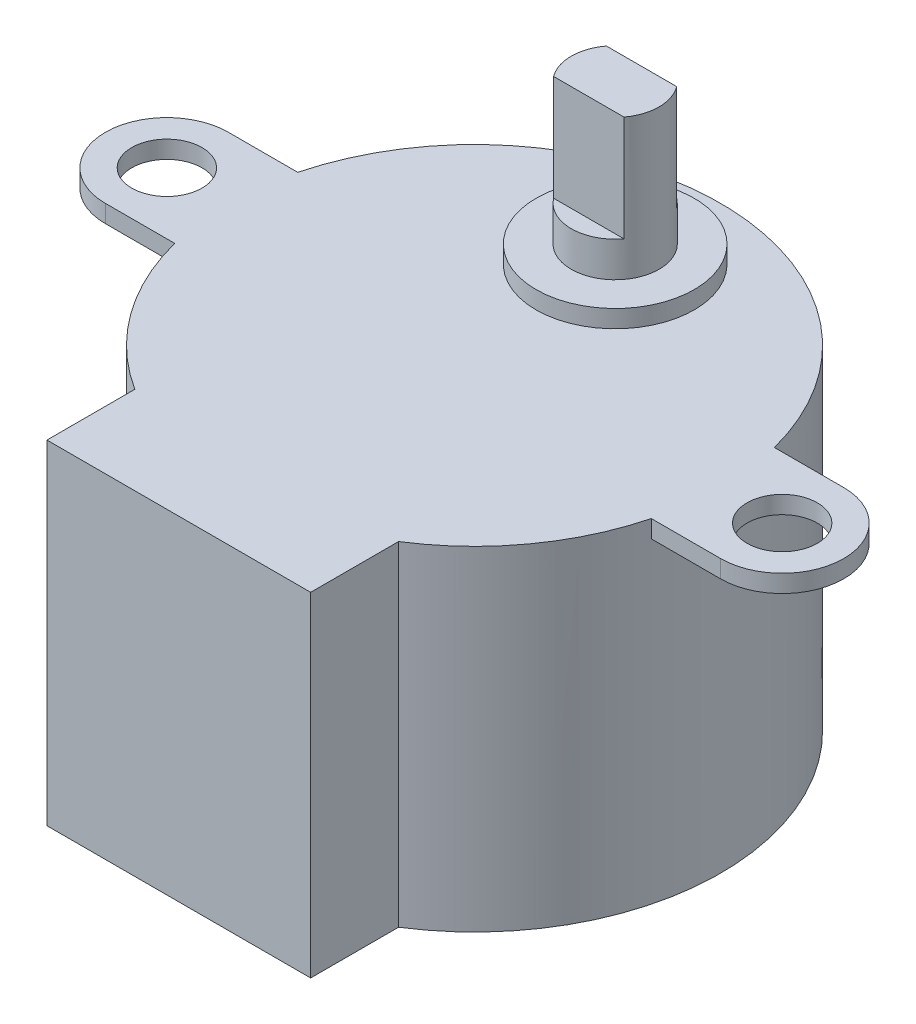
ISO-10303-21;
HEADER;
FILE_DESCRIPTION(('STEP AP214'),'2;1');
FILE_NAME('part.step','',(''),(''),'','','');
FILE_SCHEMA(('AUTOMOTIVE_DESIGN { 1 0 10303 214 1 1 1 1 }'));
ENDSEC;
DATA;
#1=APPLICATION_CONTEXT('core data for automotive mechanical design processes');
#2=APPLICATION_PROTOCOL_DEFINITION('international standard','automotive_design',2000,#1);
#3=PRODUCT_CONTEXT('',#1,'mechanical');
#4=PRODUCT('Part','Part','',(#3));
#5=PRODUCT_RELATED_PRODUCT_CATEGORY('part','',(#4));
#6=PRODUCT_DEFINITION_FORMATION('','',#4);
#7=PRODUCT_DEFINITION_CONTEXT('part definition',#1,'design');
#8=PRODUCT_DEFINITION('design','',#6,#7);
#9=PRODUCT_DEFINITION_SHAPE('','',#8);
#10=(LENGTH_UNIT() NAMED_UNIT(*) SI_UNIT(.MILLI.,.METRE.));
#11=(NAMED_UNIT(*) PLANE_ANGLE_UNIT() SI_UNIT($,.RADIAN.));
#12=(NAMED_UNIT(*) SI_UNIT($,.STERADIAN.) SOLID_ANGLE_UNIT());
#13=UNCERTAINTY_MEASURE_WITH_UNIT(LENGTH_MEASURE(1.E-05),#10,'distance_accuracy_value','');
#14=(GEOMETRIC_REPRESENTATION_CONTEXT(3) GLOBAL_UNCERTAINTY_ASSIGNED_CONTEXT((#13)) GLOBAL_UNIT_ASSIGNED_CONTEXT((#10,
#11,#12)) REPRESENTATION_CONTEXT('',''));
#15=CARTESIAN_POINT('',(0.,0.,0.));
#16=DIRECTION('',(0.,0.,1.));
#17=DIRECTION('',(1.,0.,0.));
#18=AXIS2_PLACEMENT_3D('',#15,#16,#17);
#19=CARTESIAN_POINT('',(0.,28.,-8.));
#20=DIRECTION('',(0.,-1.,0.));
#21=DIRECTION('',(0.,0.,-1.));
#22=AXIS2_PLACEMENT_3D('',#19,#20,#21);
#23=CYLINDRICAL_SURFACE('',#22,2.5);
#24=CARTESIAN_POINT('',(0.,20.,-8.));
#25=DIRECTION('',(0.,1.,0.));
#26=DIRECTION('',(0.,0.,1.));
#27=AXIS2_PLACEMENT_3D('',#24,#25,#26);
#28=CIRCLE('',#27,2.5);
#29=CARTESIAN_POINT('',(0.,20.,-5.5));
#30=VERTEX_POINT('',#29);
#31=EDGE_CURVE('E11',#30,#30,#28,.T.);
#32=ORIENTED_EDGE('',*,*,#31,.T.);
#33=EDGE_LOOP('',(#32));
#34=FACE_BOUND('',#33,.T.);
#35=DIRECTION('',(0.,1.,0.));
#36=VECTOR('',#35,1.);
#37=CARTESIAN_POINT('',(-2.,22.,-6.5));
#38=LINE('',#37,#36);
#39=CARTESIAN_POINT('',(-2.,22.,-6.5));
#40=VERTEX_POINT('',#39);
#41=CARTESIAN_POINT('',(-2.,28.,-6.5));
#42=VERTEX_POINT('',#41);
#43=EDGE_CURVE('E146',#40,#42,#38,.T.);
#44=ORIENTED_EDGE('',*,*,#43,.T.);
#45=CARTESIAN_POINT('',(0.,28.,-8.));
#46=DIRECTION('',(0.,1.,0.));
#47=DIRECTION('',(0.,0.,1.));
#48=AXIS2_PLACEMENT_3D('',#45,#46,#47);
#49=CIRCLE('',#48,2.5);
#50=CARTESIAN_POINT('',(-2.,28.,-9.5));
#51=VERTEX_POINT('',#50);
#52=EDGE_CURVE('E166',#51,#42,#49,.T.);
#53=ORIENTED_EDGE('',*,*,#52,.F.);
#54=DIRECTION('',(0.,1.,0.));
#55=VECTOR('',#54,1.);
#56=CARTESIAN_POINT('',(-2.,22.,-9.5));
#57=LINE('',#56,#55);
#58=CARTESIAN_POINT('',(-2.,22.,-9.5));
#59=VERTEX_POINT('',#58);
#60=EDGE_CURVE('E49',#59,#51,#57,.T.);
#61=ORIENTED_EDGE('',*,*,#60,.F.);
#62=CARTESIAN_POINT('',(0.,22.,-8.));
#63=DIRECTION('',(0.,1.,0.));
#64=DIRECTION('',(0.,0.,1.));
#65=AXIS2_PLACEMENT_3D('',#62,#63,#64);
#66=CIRCLE('',#65,2.5);
#67=CARTESIAN_POINT('',(2.,22.,-9.5));
#68=VERTEX_POINT('',#67);
#69=EDGE_CURVE('E168',#68,#59,#66,.T.);
#70=ORIENTED_EDGE('',*,*,#69,.F.);
#71=DIRECTION('',(0.,1.,0.));
#72=VECTOR('',#71,1.);
#73=CARTESIAN_POINT('',(2.,22.,-9.5));
#74=LINE('',#73,#72);
#75=CARTESIAN_POINT('',(2.,28.,-9.5));
#76=VERTEX_POINT('',#75);
#77=EDGE_CURVE('E165',#68,#76,#74,.T.);
#78=ORIENTED_EDGE('',*,*,#77,.T.);
#79=CARTESIAN_POINT('',(2.,28.,-6.5));
#80=VERTEX_POINT('',#79);
#81=EDGE_CURVE('E178',#80,#76,#49,.T.);
#82=ORIENTED_EDGE('',*,*,#81,.F.);
#83=DIRECTION('',(0.,1.,0.));
#84=VECTOR('',#83,1.);
#85=CARTESIAN_POINT('',(2.,22.,-6.5));
#86=LINE('',#85,#84);
#87=CARTESIAN_POINT('',(2.,22.,-6.5));
#88=VERTEX_POINT('',#87);
#89=EDGE_CURVE('E57',#88,#80,#86,.T.);
#90=ORIENTED_EDGE('',*,*,#89,.F.);
#91=CARTESIAN_POINT('',(0.,22.,-8.));
#92=DIRECTION('',(0.,1.,0.));
#93=DIRECTION('',(0.,0.,1.));
#94=AXIS2_PLACEMENT_3D('',#91,#92,#93);
#95=CIRCLE('',#94,2.5);
#96=EDGE_CURVE('E156',#40,#88,#95,.T.);
#97=ORIENTED_EDGE('',*,*,#96,.F.);
#98=EDGE_LOOP('',(#44,#53,#61,#70,#78,#82,#90,#97));
#99=FACE_BOUND('',#98,.T.);
#100=ADVANCED_FACE('F33',(#34,#99),#23,.T.);
#101=CARTESIAN_POINT('',(0.,28.,-8.));
#102=DIRECTION('',(0.,1.,0.));
#103=DIRECTION('',(0.,0.,1.));
#104=AXIS2_PLACEMENT_3D('',#101,#102,#103);
#105=PLANE('',#104);
#106=ORIENTED_EDGE('',*,*,#52,.T.);
#107=DIRECTION('',(1.,0.,0.));
#108=VECTOR('',#107,1.);
#109=CARTESIAN_POINT('',(0.,28.,-6.5));
#110=LINE('',#109,#108);
#111=EDGE_CURVE('E151',#42,#80,#110,.T.);
#112=ORIENTED_EDGE('',*,*,#111,.T.);
#113=ORIENTED_EDGE('',*,*,#81,.T.);
#114=DIRECTION('',(1.,0.,0.));
#115=VECTOR('',#114,1.);
#116=CARTESIAN_POINT('',(0.,28.,-9.5));
#117=LINE('',#116,#115);
#118=EDGE_CURVE('E171',#51,#76,#117,.T.);
#119=ORIENTED_EDGE('',*,*,#118,.F.);
#120=EDGE_LOOP('',(#106,#112,#113,#119));
#121=FACE_BOUND('',#120,.T.);
#122=ADVANCED_FACE('F341',(#121),#105,.T.);
#123=CARTESIAN_POINT('',(0.,19.,0.));
#124=DIRECTION('',(0.,-1.,0.));
#125=DIRECTION('',(0.,0.,-1.));
#126=AXIS2_PLACEMENT_3D('',#123,#124,#125);
#127=CYLINDRICAL_SURFACE('',#126,14.);
#128=CARTESIAN_POINT('',(0.,18.,0.));
#129=DIRECTION('',(0.,-1.,0.));
#130=DIRECTION('',(0.,0.,1.));
#131=AXIS2_PLACEMENT_3D('',#128,#129,#130);
#132=CIRCLE('',#131,14.);
#133=CARTESIAN_POINT('',(-13.555441711726,18.,3.49999999999999));
#134=VERTEX_POINT('',#133);
#135=CARTESIAN_POINT('',(-13.555441711726,18.,-3.5));
#136=VERTEX_POINT('',#135);
#137=EDGE_CURVE('E201',#134,#136,#132,.T.);
#138=ORIENTED_EDGE('',*,*,#137,.T.);
#139=DIRECTION('',(0.,1.,0.));
#140=VECTOR('',#139,1.);
#141=CARTESIAN_POINT('',(-13.555441711726,18.,-3.5));
#142=LINE('',#141,#140);
#143=CARTESIAN_POINT('',(-13.555441711726,19.,-3.5));
#144=VERTEX_POINT('',#143);
#145=EDGE_CURVE('E217',#136,#144,#142,.T.);
#146=ORIENTED_EDGE('',*,*,#145,.T.);
#147=CARTESIAN_POINT('',(0.,19.,0.));
#148=DIRECTION('',(0.,1.,0.));
#149=DIRECTION('',(0.,0.,1.));
#150=AXIS2_PLACEMENT_3D('',#147,#148,#149);
#151=CIRCLE('',#150,14.);
#152=CARTESIAN_POINT('',(13.555441711726,19.,-3.5));
#153=VERTEX_POINT('',#152);
#154=EDGE_CURVE('E264',#153,#144,#151,.T.);
#155=ORIENTED_EDGE('',*,*,#154,.F.);
#156=DIRECTION('',(0.,1.,0.));
#157=VECTOR('',#156,1.);
#158=CARTESIAN_POINT('',(13.555441711726,18.,-3.5));
#159=LINE('',#158,#157);
#160=CARTESIAN_POINT('',(13.555441711726,18.,-3.5));
#161=VERTEX_POINT('',#160);
#162=EDGE_CURVE('E250',#161,#153,#159,.T.);
#163=ORIENTED_EDGE('',*,*,#162,.F.);
#164=CARTESIAN_POINT('',(0.,18.,0.));
#165=DIRECTION('',(0.,-1.,0.));
#166=DIRECTION('',(0.,0.,-1.));
#167=AXIS2_PLACEMENT_3D('',#164,#165,#166);
#168=CIRCLE('',#167,14.);
#169=CARTESIAN_POINT('',(13.555441711726,18.,3.5));
#170=VERTEX_POINT('',#169);
#171=EDGE_CURVE('E230',#161,#170,#168,.T.);
#172=ORIENTED_EDGE('',*,*,#171,.T.);
#173=DIRECTION('',(0.,1.,0.));
#174=VECTOR('',#173,1.);
#175=CARTESIAN_POINT('',(13.555441711726,18.,3.5));
#176=LINE('',#175,#174);
#177=CARTESIAN_POINT('',(13.555441711726,19.,3.5));
#178=VERTEX_POINT('',#177);
#179=EDGE_CURVE('E243',#170,#178,#176,.T.);
#180=ORIENTED_EDGE('',*,*,#179,.T.);
#181=CARTESIAN_POINT('',(7.5,19.,11.8215904175369));
#182=VERTEX_POINT('',#181);
#183=EDGE_CURVE('E260',#182,#178,#151,.T.);
#184=ORIENTED_EDGE('',*,*,#183,.F.);
#185=DIRECTION('',(0.,-1.,0.));
#186=VECTOR('',#185,1.);
#187=CARTESIAN_POINT('',(7.5,19.,11.8215904175369));
#188=LINE('',#187,#186);
#189=CARTESIAN_POINT('',(7.5,0.,11.8215904175369));
#190=VERTEX_POINT('',#189);
#191=EDGE_CURVE('E271',#182,#190,#188,.T.);
#192=ORIENTED_EDGE('',*,*,#191,.T.);
#193=CARTESIAN_POINT('',(0.,0.,0.));
#194=DIRECTION('',(0.,1.,0.));
#195=DIRECTION('',(0.,0.,1.));
#196=AXIS2_PLACEMENT_3D('',#193,#194,#195);
#197=CIRCLE('',#196,14.);
#198=CARTESIAN_POINT('',(-7.5,0.,11.8215904175369));
#199=VERTEX_POINT('',#198);
#200=EDGE_CURVE('E253',#190,#199,#197,.T.);
#201=ORIENTED_EDGE('',*,*,#200,.T.);
#202=DIRECTION('',(0.,-1.,0.));
#203=VECTOR('',#202,1.);
#204=CARTESIAN_POINT('',(-7.5,19.,11.8215904175369));
#205=LINE('',#204,#203);
#206=CARTESIAN_POINT('',(-7.5,19.,11.8215904175369));
#207=VERTEX_POINT('',#206);
#208=EDGE_CURVE('E37',#207,#199,#205,.T.);
#209=ORIENTED_EDGE('',*,*,#208,.F.);
#210=CARTESIAN_POINT('',(-13.555441711726,19.,3.5));
#211=VERTEX_POINT('',#210);
#212=EDGE_CURVE('E265',#211,#207,#151,.T.);
#213=ORIENTED_EDGE('',*,*,#212,.F.);
#214=DIRECTION('',(0.,1.,0.));
#215=VECTOR('',#214,1.);
#216=CARTESIAN_POINT('',(-13.555441711726,18.,3.49999999999999));
#217=LINE('',#216,#215);
#218=EDGE_CURVE('E220',#134,#211,#217,.T.);
#219=ORIENTED_EDGE('',*,*,#218,.F.);
#220=EDGE_LOOP('',(#138,#146,#155,#163,#172,#180,#184,#192,#201,#209,#213,#219));
#221=FACE_BOUND('',#220,.T.);
#222=ADVANCED_FACE('F35',(#221),#127,.T.);
#223=CARTESIAN_POINT('',(-7.5,19.,11.8215904175369));
#224=DIRECTION('',(1.,0.,0.));
#225=DIRECTION('',(0.,0.,-1.));
#226=AXIS2_PLACEMENT_3D('',#223,#224,#225);
#227=PLANE('',#226);
#228=DIRECTION('',(0.,0.,1.));
#229=VECTOR('',#228,1.);
#230=CARTESIAN_POINT('',(-7.5,0.,11.8215904175369));
#231=LINE('',#230,#229);
#232=CARTESIAN_POINT('',(-7.5,0.,16.8215904175369));
#233=VERTEX_POINT('',#232);
#234=EDGE_CURVE('E274',#199,#233,#231,.T.);
#235=ORIENTED_EDGE('',*,*,#234,.T.);
#236=DIRECTION('',(0.,-1.,0.));
#237=VECTOR('',#236,1.);
#238=CARTESIAN_POINT('',(-7.5,19.,16.8215904175369));
#239=LINE('',#238,#237);
#240=CARTESIAN_POINT('',(-7.5,19.,16.8215904175369));
#241=VERTEX_POINT('',#240);
#242=EDGE_CURVE('E284',#241,#233,#239,.T.);
#243=ORIENTED_EDGE('',*,*,#242,.F.);
#244=DIRECTION('',(0.,0.,1.));
#245=VECTOR('',#244,1.);
#246=CARTESIAN_POINT('',(-7.5,19.,11.8215904175369));
#247=LINE('',#246,#245);
#248=EDGE_CURVE('E263',#207,#241,#247,.T.);
#249=ORIENTED_EDGE('',*,*,#248,.F.);
#250=ORIENTED_EDGE('',*,*,#208,.T.);
#251=EDGE_LOOP('',(#235,#243,#249,#250));
#252=FACE_BOUND('',#251,.T.);
#253=ADVANCED_FACE('F294',(#252),#227,.F.);
#254=CARTESIAN_POINT('',(-7.5,19.,16.8215904175369));
#255=DIRECTION('',(0.,0.,-1.));
#256=DIRECTION('',(-1.,0.,0.));
#257=AXIS2_PLACEMENT_3D('',#254,#255,#256);
#258=PLANE('',#257);
#259=DIRECTION('',(1.,0.,0.));
#260=VECTOR('',#259,1.);
#261=CARTESIAN_POINT('',(-7.5,0.,16.8215904175369));
#262=LINE('',#261,#260);
#263=CARTESIAN_POINT('',(7.5,0.,16.8215904175369));
#264=VERTEX_POINT('',#263);
#265=EDGE_CURVE('E276',#233,#264,#262,.T.);
#266=ORIENTED_EDGE('',*,*,#265,.T.);
#267=DIRECTION('',(0.,-1.,0.));
#268=VECTOR('',#267,1.);
#269=CARTESIAN_POINT('',(7.5,19.,16.8215904175369));
#270=LINE('',#269,#268);
#271=CARTESIAN_POINT('',(7.5,19.,16.8215904175369));
#272=VERTEX_POINT('',#271);
#273=EDGE_CURVE('E282',#272,#264,#270,.T.);
#274=ORIENTED_EDGE('',*,*,#273,.F.);
#275=DIRECTION('',(1.,0.,0.));
#276=VECTOR('',#275,1.);
#277=CARTESIAN_POINT('',(-7.5,19.,16.8215904175369));
#278=LINE('',#277,#276);
#279=EDGE_CURVE('E267',#241,#272,#278,.T.);
#280=ORIENTED_EDGE('',*,*,#279,.F.);
#281=ORIENTED_EDGE('',*,*,#242,.T.);
#282=EDGE_LOOP('',(#266,#274,#280,#281));
#283=FACE_BOUND('',#282,.T.);
#284=ADVANCED_FACE('F304',(#283),#258,.F.);
#285=CARTESIAN_POINT('',(7.5,19.,11.8215904175369));
#286=DIRECTION('',(-1.,0.,0.));
#287=DIRECTION('',(0.,0.,1.));
#288=AXIS2_PLACEMENT_3D('',#285,#286,#287);
#289=PLANE('',#288);
#290=DIRECTION('',(0.,0.,-1.));
#291=VECTOR('',#290,1.);
#292=CARTESIAN_POINT('',(7.5,0.,11.8215904175369));
#293=LINE('',#292,#291);
#294=EDGE_CURVE('E278',#264,#190,#293,.T.);
#295=ORIENTED_EDGE('',*,*,#294,.T.);
#296=ORIENTED_EDGE('',*,*,#191,.F.);
#297=DIRECTION('',(0.,0.,-1.));
#298=VECTOR('',#297,1.);
#299=CARTESIAN_POINT('',(7.5,19.,11.8215904175369));
#300=LINE('',#299,#298);
#301=EDGE_CURVE('E269',#272,#182,#300,.T.);
#302=ORIENTED_EDGE('',*,*,#301,.F.);
#303=ORIENTED_EDGE('',*,*,#273,.T.);
#304=EDGE_LOOP('',(#295,#296,#302,#303));
#305=FACE_BOUND('',#304,.T.);
#306=ADVANCED_FACE('F307',(#305),#289,.F.);
#307=CARTESIAN_POINT('',(0.,19.,0.));
#308=DIRECTION('',(0.,1.,0.));
#309=DIRECTION('',(0.,0.,1.));
#310=AXIS2_PLACEMENT_3D('',#307,#308,#309);
#311=PLANE('',#310);
#312=CARTESIAN_POINT('',(0.,19.,-8.));
#313=DIRECTION('',(0.,1.,0.));
#314=DIRECTION('',(0.,0.,1.));
#315=AXIS2_PLACEMENT_3D('',#312,#313,#314);
#316=CIRCLE('',#315,4.5);
#317=CARTESIAN_POINT('',(0.,19.,-3.5));
#318=VERTEX_POINT('',#317);
#319=EDGE_CURVE('E180',#318,#318,#316,.T.);
#320=ORIENTED_EDGE('',*,*,#319,.F.);
#321=EDGE_LOOP('',(#320));
#322=FACE_BOUND('',#321,.T.);
#323=ORIENTED_EDGE('',*,*,#183,.T.);
#324=DIRECTION('',(1.,0.,0.));
#325=VECTOR('',#324,1.);
#326=CARTESIAN_POINT('',(17.5,19.,3.5));
#327=LINE('',#326,#325);
#328=CARTESIAN_POINT('',(17.5,19.,3.5));
#329=VERTEX_POINT('',#328);
#330=EDGE_CURVE('E227',#178,#329,#327,.T.);
#331=ORIENTED_EDGE('',*,*,#330,.T.);
#332=CARTESIAN_POINT('',(17.5,19.,0.));
#333=DIRECTION('',(0.,1.,0.));
#334=DIRECTION('',(0.,0.,-1.));
#335=AXIS2_PLACEMENT_3D('',#332,#333,#334);
#336=CIRCLE('',#335,3.5);
#337=CARTESIAN_POINT('',(17.5,19.,-3.5));
#338=VERTEX_POINT('',#337);
#339=EDGE_CURVE('E246',#329,#338,#336,.T.);
#340=ORIENTED_EDGE('',*,*,#339,.T.);
#341=DIRECTION('',(-1.,0.,0.));
#342=VECTOR('',#341,1.);
#343=CARTESIAN_POINT('',(13.555441711726,19.,-3.5));
#344=LINE('',#343,#342);
#345=EDGE_CURVE('E234',#338,#153,#344,.T.);
#346=ORIENTED_EDGE('',*,*,#345,.T.);
#347=ORIENTED_EDGE('',*,*,#154,.T.);
#348=DIRECTION('',(-1.,0.,0.));
#349=VECTOR('',#348,1.);
#350=CARTESIAN_POINT('',(-13.555441711726,19.,-3.5));
#351=LINE('',#350,#349);
#352=CARTESIAN_POINT('',(-17.5,19.,-3.5));
#353=VERTEX_POINT('',#352);
#354=EDGE_CURVE('E198',#144,#353,#351,.T.);
#355=ORIENTED_EDGE('',*,*,#354,.T.);
#356=CARTESIAN_POINT('',(-17.5,19.,0.));
#357=DIRECTION('',(0.,1.,0.));
#358=DIRECTION('',(0.,0.,1.));
#359=AXIS2_PLACEMENT_3D('',#356,#357,#358);
#360=CIRCLE('',#359,3.5);
#361=CARTESIAN_POINT('',(-17.5,19.,3.5));
#362=VERTEX_POINT('',#361);
#363=EDGE_CURVE('E191',#353,#362,#360,.T.);
#364=ORIENTED_EDGE('',*,*,#363,.T.);
#365=DIRECTION('',(1.,0.,0.));
#366=VECTOR('',#365,1.);
#367=CARTESIAN_POINT('',(-17.5,19.,3.5));
#368=LINE('',#367,#366);
#369=EDGE_CURVE('E210',#362,#211,#368,.T.);
#370=ORIENTED_EDGE('',*,*,#369,.T.);
#371=ORIENTED_EDGE('',*,*,#212,.T.);
#372=ORIENTED_EDGE('',*,*,#248,.T.);
#373=ORIENTED_EDGE('',*,*,#279,.T.);
#374=ORIENTED_EDGE('',*,*,#301,.T.);
#375=EDGE_LOOP('',(#323,#331,#340,#346,#347,#355,#364,#370,#371,#372,#373,#374));
#376=FACE_BOUND('',#375,.T.);
#377=CARTESIAN_POINT('',(17.5,19.,0.));
#378=DIRECTION('',(0.,1.,0.));
#379=DIRECTION('',(0.,0.,1.));
#380=AXIS2_PLACEMENT_3D('',#377,#378,#379);
#381=CIRCLE('',#380,2.);
#382=CARTESIAN_POINT('',(17.5,19.,2.));
#383=VERTEX_POINT('',#382);
#384=EDGE_CURVE('E216',#383,#383,#381,.T.);
#385=ORIENTED_EDGE('',*,*,#384,.F.);
#386=EDGE_LOOP('',(#385));
#387=FACE_BOUND('',#386,.T.);
#388=CARTESIAN_POINT('',(-17.5,19.,0.));
#389=DIRECTION('',(0.,1.,0.));
#390=DIRECTION('',(0.,0.,-1.));
#391=AXIS2_PLACEMENT_3D('',#388,#389,#390);
#392=CIRCLE('',#391,2.);
#393=CARTESIAN_POINT('',(-17.5,19.,-2.));
#394=VERTEX_POINT('',#393);
#395=EDGE_CURVE('E185',#394,#394,#392,.T.);
#396=ORIENTED_EDGE('',*,*,#395,.F.);
#397=EDGE_LOOP('',(#396));
#398=FACE_BOUND('',#397,.T.);
#399=ADVANCED_FACE('F309',(#322,#376,#387,#398),#311,.T.);
#400=CARTESIAN_POINT('',(0.,0.,0.));
#401=DIRECTION('',(0.,1.,0.));
#402=DIRECTION('',(0.,0.,1.));
#403=AXIS2_PLACEMENT_3D('',#400,#401,#402);
#404=PLANE('',#403);
#405=ORIENTED_EDGE('',*,*,#200,.F.);
#406=ORIENTED_EDGE('',*,*,#294,.F.);
#407=ORIENTED_EDGE('',*,*,#265,.F.);
#408=ORIENTED_EDGE('',*,*,#234,.F.);
#409=EDGE_LOOP('',(#405,#406,#407,#408));
#410=FACE_BOUND('',#409,.T.);
#411=ADVANCED_FACE('F302',(#410),#404,.F.);
#412=CARTESIAN_POINT('',(13.555441711726,18.,-3.5));
#413=DIRECTION('',(0.,0.,-1.));
#414=DIRECTION('',(-1.,0.,0.));
#415=AXIS2_PLACEMENT_3D('',#412,#413,#414);
#416=PLANE('',#415);
#417=ORIENTED_EDGE('',*,*,#345,.F.);
#418=DIRECTION('',(0.,1.,0.));
#419=VECTOR('',#418,1.);
#420=CARTESIAN_POINT('',(17.5,18.,-3.5));
#421=LINE('',#420,#419);
#422=CARTESIAN_POINT('',(17.5,18.,-3.5));
#423=VERTEX_POINT('',#422);
#424=EDGE_CURVE('E254',#423,#338,#421,.T.);
#425=ORIENTED_EDGE('',*,*,#424,.F.);
#426=DIRECTION('',(-1.,0.,0.));
#427=VECTOR('',#426,1.);
#428=CARTESIAN_POINT('',(13.555441711726,18.,-3.5));
#429=LINE('',#428,#427);
#430=EDGE_CURVE('E240',#423,#161,#429,.T.);
#431=ORIENTED_EDGE('',*,*,#430,.T.);
#432=ORIENTED_EDGE('',*,*,#162,.T.);
#433=EDGE_LOOP('',(#417,#425,#431,#432));
#434=FACE_BOUND('',#433,.T.);
#435=ADVANCED_FACE('F375',(#434),#416,.T.);
#436=CARTESIAN_POINT('',(17.5,18.,0.));
#437=DIRECTION('',(0.,1.,0.));
#438=DIRECTION('',(0.,0.,1.));
#439=AXIS2_PLACEMENT_3D('',#436,#437,#438);
#440=CYLINDRICAL_SURFACE('',#439,3.5);
#441=ORIENTED_EDGE('',*,*,#339,.F.);
#442=DIRECTION('',(0.,1.,0.));
#443=VECTOR('',#442,1.);
#444=CARTESIAN_POINT('',(17.5,18.,3.5));
#445=LINE('',#444,#443);
#446=CARTESIAN_POINT('',(17.5,18.,3.5));
#447=VERTEX_POINT('',#446);
#448=EDGE_CURVE('E256',#447,#329,#445,.T.);
#449=ORIENTED_EDGE('',*,*,#448,.F.);
#450=CARTESIAN_POINT('',(17.5,18.,0.));
#451=DIRECTION('',(0.,1.,0.));
#452=DIRECTION('',(0.,0.,-1.));
#453=AXIS2_PLACEMENT_3D('',#450,#451,#452);
#454=CIRCLE('',#453,3.5);
#455=EDGE_CURVE('E237',#447,#423,#454,.T.);
#456=ORIENTED_EDGE('',*,*,#455,.T.);
#457=ORIENTED_EDGE('',*,*,#424,.T.);
#458=EDGE_LOOP('',(#441,#449,#456,#457));
#459=FACE_BOUND('',#458,.T.);
#460=ADVANCED_FACE('F504',(#459),#440,.T.);
#461=CARTESIAN_POINT('',(17.5,18.,3.5));
#462=DIRECTION('',(0.,0.,1.));
#463=DIRECTION('',(1.,0.,0.));
#464=AXIS2_PLACEMENT_3D('',#461,#462,#463);
#465=PLANE('',#464);
#466=ORIENTED_EDGE('',*,*,#330,.F.);
#467=ORIENTED_EDGE('',*,*,#179,.F.);
#468=DIRECTION('',(1.,0.,0.));
#469=VECTOR('',#468,1.);
#470=CARTESIAN_POINT('',(17.5,18.,3.5));
#471=LINE('',#470,#469);
#472=EDGE_CURVE('E233',#170,#447,#471,.T.);
#473=ORIENTED_EDGE('',*,*,#472,.T.);
#474=ORIENTED_EDGE('',*,*,#448,.T.);
#475=EDGE_LOOP('',(#466,#467,#473,#474));
#476=FACE_BOUND('',#475,.T.);
#477=ADVANCED_FACE('F380',(#476),#465,.T.);
#478=CARTESIAN_POINT('',(0.,18.,0.));
#479=DIRECTION('',(0.,-1.,0.));
#480=DIRECTION('',(0.,0.,-1.));
#481=AXIS2_PLACEMENT_3D('',#478,#479,#480);
#482=PLANE('',#481);
#483=CARTESIAN_POINT('',(17.5,18.,0.));
#484=DIRECTION('',(0.,1.,0.));
#485=DIRECTION('',(0.,0.,1.));
#486=AXIS2_PLACEMENT_3D('',#483,#484,#485);
#487=CIRCLE('',#486,2.);
#488=CARTESIAN_POINT('',(17.5,18.,2.));
#489=VERTEX_POINT('',#488);
#490=EDGE_CURVE('E224',#489,#489,#487,.T.);
#491=ORIENTED_EDGE('',*,*,#490,.T.);
#492=EDGE_LOOP('',(#491));
#493=FACE_BOUND('',#492,.T.);
#494=ORIENTED_EDGE('',*,*,#171,.F.);
#495=ORIENTED_EDGE('',*,*,#430,.F.);
#496=ORIENTED_EDGE('',*,*,#455,.F.);
#497=ORIENTED_EDGE('',*,*,#472,.F.);
#498=EDGE_LOOP('',(#494,#495,#496,#497));
#499=FACE_BOUND('',#498,.T.);
#500=ADVANCED_FACE('F485',(#493,#499),#482,.T.);
#501=CARTESIAN_POINT('',(17.5,18.,0.));
#502=DIRECTION('',(0.,1.,0.));
#503=DIRECTION('',(0.,0.,1.));
#504=AXIS2_PLACEMENT_3D('',#501,#502,#503);
#505=CYLINDRICAL_SURFACE('',#504,2.);
#506=ORIENTED_EDGE('',*,*,#490,.F.);
#507=EDGE_LOOP('',(#506));
#508=FACE_BOUND('',#507,.T.);
#509=ORIENTED_EDGE('',*,*,#384,.T.);
#510=EDGE_LOOP('',(#509));
#511=FACE_BOUND('',#510,.T.);
#512=ADVANCED_FACE('F477',(#508,#511),#505,.F.);
#513=CARTESIAN_POINT('',(-17.5,18.,0.));
#514=DIRECTION('',(0.,1.,0.));
#515=DIRECTION('',(0.,0.,1.));
#516=AXIS2_PLACEMENT_3D('',#513,#514,#515);
#517=CYLINDRICAL_SURFACE('',#516,3.5);
#518=ORIENTED_EDGE('',*,*,#363,.F.);
#519=DIRECTION('',(0.,1.,0.));
#520=VECTOR('',#519,1.);
#521=CARTESIAN_POINT('',(-17.5,18.,-3.5));
#522=LINE('',#521,#520);
#523=CARTESIAN_POINT('',(-17.5,18.,-3.5));
#524=VERTEX_POINT('',#523);
#525=EDGE_CURVE('E214',#524,#353,#522,.T.);
#526=ORIENTED_EDGE('',*,*,#525,.F.);
#527=CARTESIAN_POINT('',(-17.5,18.,0.));
#528=DIRECTION('',(0.,1.,0.));
#529=DIRECTION('',(0.,0.,1.));
#530=AXIS2_PLACEMENT_3D('',#527,#528,#529);
#531=CIRCLE('',#530,3.5);
#532=CARTESIAN_POINT('',(-17.5,18.,3.5));
#533=VERTEX_POINT('',#532);
#534=EDGE_CURVE('E194',#524,#533,#531,.T.);
#535=ORIENTED_EDGE('',*,*,#534,.T.);
#536=DIRECTION('',(0.,1.,0.));
#537=VECTOR('',#536,1.);
#538=CARTESIAN_POINT('',(-17.5,18.,3.5));
#539=LINE('',#538,#537);
#540=EDGE_CURVE('E207',#533,#362,#539,.T.);
#541=ORIENTED_EDGE('',*,*,#540,.T.);
#542=EDGE_LOOP('',(#518,#526,#535,#541));
#543=FACE_BOUND('',#542,.T.);
#544=ADVANCED_FACE('F326',(#543),#517,.T.);
#545=CARTESIAN_POINT('',(-13.555441711726,18.,-3.5));
#546=DIRECTION('',(0.,0.,-1.));
#547=DIRECTION('',(-1.,0.,0.));
#548=AXIS2_PLACEMENT_3D('',#545,#546,#547);
#549=PLANE('',#548);
#550=ORIENTED_EDGE('',*,*,#354,.F.);
#551=ORIENTED_EDGE('',*,*,#145,.F.);
#552=DIRECTION('',(-1.,0.,0.));
#553=VECTOR('',#552,1.);
#554=CARTESIAN_POINT('',(-13.555441711726,18.,-3.5));
#555=LINE('',#554,#553);
#556=EDGE_CURVE('E204',#136,#524,#555,.T.);
#557=ORIENTED_EDGE('',*,*,#556,.T.);
#558=ORIENTED_EDGE('',*,*,#525,.T.);
#559=EDGE_LOOP('',(#550,#551,#557,#558));
#560=FACE_BOUND('',#559,.T.);
#561=ADVANCED_FACE('F319',(#560),#549,.T.);
#562=CARTESIAN_POINT('',(-17.5,18.,3.5));
#563=DIRECTION('',(0.,0.,1.));
#564=DIRECTION('',(1.,0.,0.));
#565=AXIS2_PLACEMENT_3D('',#562,#563,#564);
#566=PLANE('',#565);
#567=ORIENTED_EDGE('',*,*,#369,.F.);
#568=ORIENTED_EDGE('',*,*,#540,.F.);
#569=DIRECTION('',(1.,0.,0.));
#570=VECTOR('',#569,1.);
#571=CARTESIAN_POINT('',(-17.5,18.,3.5));
#572=LINE('',#571,#570);
#573=EDGE_CURVE('E197',#533,#134,#572,.T.);
#574=ORIENTED_EDGE('',*,*,#573,.T.);
#575=ORIENTED_EDGE('',*,*,#218,.T.);
#576=EDGE_LOOP('',(#567,#568,#574,#575));
#577=FACE_BOUND('',#576,.T.);
#578=ADVANCED_FACE('F328',(#577),#566,.T.);
#579=CARTESIAN_POINT('',(-17.5,18.,0.));
#580=DIRECTION('',(0.,1.,0.));
#581=DIRECTION('',(0.,0.,1.));
#582=AXIS2_PLACEMENT_3D('',#579,#580,#581);
#583=PLANE('',#582);
#584=CARTESIAN_POINT('',(-17.5,18.,0.));
#585=DIRECTION('',(0.,1.,0.));
#586=DIRECTION('',(0.,0.,-1.));
#587=AXIS2_PLACEMENT_3D('',#584,#585,#586);
#588=CIRCLE('',#587,2.);
#589=CARTESIAN_POINT('',(-17.5,18.,-2.));
#590=VERTEX_POINT('',#589);
#591=EDGE_CURVE('E188',#590,#590,#588,.T.);
#592=ORIENTED_EDGE('',*,*,#591,.T.);
#593=EDGE_LOOP('',(#592));
#594=FACE_BOUND('',#593,.T.);
#595=ORIENTED_EDGE('',*,*,#534,.F.);
#596=ORIENTED_EDGE('',*,*,#556,.F.);
#597=ORIENTED_EDGE('',*,*,#137,.F.);
#598=ORIENTED_EDGE('',*,*,#573,.F.);
#599=EDGE_LOOP('',(#595,#596,#597,#598));
#600=FACE_BOUND('',#599,.T.);
#601=ADVANCED_FACE('F322',(#594,#600),#583,.F.);
#602=CARTESIAN_POINT('',(-17.5,18.,0.));
#603=DIRECTION('',(0.,1.,0.));
#604=DIRECTION('',(0.,0.,1.));
#605=AXIS2_PLACEMENT_3D('',#602,#603,#604);
#606=CYLINDRICAL_SURFACE('',#605,2.);
#607=ORIENTED_EDGE('',*,*,#591,.F.);
#608=EDGE_LOOP('',(#607));
#609=FACE_BOUND('',#608,.T.);
#610=ORIENTED_EDGE('',*,*,#395,.T.);
#611=EDGE_LOOP('',(#610));
#612=FACE_BOUND('',#611,.T.);
#613=ADVANCED_FACE('F335',(#609,#612),#606,.F.);
#614=CARTESIAN_POINT('',(0.,20.,-8.));
#615=DIRECTION('',(0.,-1.,0.));
#616=DIRECTION('',(0.,0.,-1.));
#617=AXIS2_PLACEMENT_3D('',#614,#615,#616);
#618=CYLINDRICAL_SURFACE('',#617,4.5);
#619=CARTESIAN_POINT('',(0.,20.,-8.));
#620=DIRECTION('',(0.,1.,0.));
#621=DIRECTION('',(0.,0.,1.));
#622=AXIS2_PLACEMENT_3D('',#619,#620,#621);
#623=CIRCLE('',#622,4.5);
#624=CARTESIAN_POINT('',(0.,20.,-3.5));
#625=VERTEX_POINT('',#624);
#626=EDGE_CURVE('E182',#625,#625,#623,.T.);
#627=ORIENTED_EDGE('',*,*,#626,.F.);
#628=EDGE_LOOP('',(#627));
#629=FACE_BOUND('',#628,.T.);
#630=ORIENTED_EDGE('',*,*,#319,.T.);
#631=EDGE_LOOP('',(#630));
#632=FACE_BOUND('',#631,.T.);
#633=ADVANCED_FACE('F355',(#629,#632),#618,.T.);
#634=CARTESIAN_POINT('',(0.,20.,-8.));
#635=DIRECTION('',(0.,1.,0.));
#636=DIRECTION('',(0.,0.,1.));
#637=AXIS2_PLACEMENT_3D('',#634,#635,#636);
#638=PLANE('',#637);
#639=ORIENTED_EDGE('',*,*,#31,.F.);
#640=EDGE_LOOP('',(#639));
#641=FACE_BOUND('',#640,.T.);
#642=ORIENTED_EDGE('',*,*,#626,.T.);
#643=EDGE_LOOP('',(#642));
#644=FACE_BOUND('',#643,.T.);
#645=ADVANCED_FACE('F351',(#641,#644),#638,.T.);
#646=CARTESIAN_POINT('',(0.,22.,-9.5));
#647=DIRECTION('',(0.,0.,1.));
#648=DIRECTION('',(1.,0.,0.));
#649=AXIS2_PLACEMENT_3D('',#646,#647,#648);
#650=PLANE('',#649);
#651=ORIENTED_EDGE('',*,*,#118,.T.);
#652=ORIENTED_EDGE('',*,*,#77,.F.);
#653=DIRECTION('',(1.,0.,0.));
#654=VECTOR('',#653,1.);
#655=CARTESIAN_POINT('',(0.,22.,-9.5));
#656=LINE('',#655,#654);
#657=EDGE_CURVE('E170',#59,#68,#656,.T.);
#658=ORIENTED_EDGE('',*,*,#657,.F.);
#659=ORIENTED_EDGE('',*,*,#60,.T.);
#660=EDGE_LOOP('',(#651,#652,#658,#659));
#661=FACE_BOUND('',#660,.T.);
#662=ADVANCED_FACE('F354',(#661),#650,.F.);
#663=CARTESIAN_POINT('',(0.,22.,0.));
#664=DIRECTION('',(0.,1.,0.));
#665=DIRECTION('',(0.,0.,1.));
#666=AXIS2_PLACEMENT_3D('',#663,#664,#665);
#667=PLANE('',#666);
#668=ORIENTED_EDGE('',*,*,#69,.T.);
#669=ORIENTED_EDGE('',*,*,#657,.T.);
#670=EDGE_LOOP('',(#668,#669));
#671=FACE_BOUND('',#670,.T.);
#672=ADVANCED_FACE('F409',(#671),#667,.T.);
#673=CARTESIAN_POINT('',(0.,22.,-6.5));
#674=DIRECTION('',(0.,0.,1.));
#675=DIRECTION('',(1.,0.,0.));
#676=AXIS2_PLACEMENT_3D('',#673,#674,#675);
#677=PLANE('',#676);
#678=ORIENTED_EDGE('',*,*,#111,.F.);
#679=ORIENTED_EDGE('',*,*,#43,.F.);
#680=DIRECTION('',(1.,0.,0.));
#681=VECTOR('',#680,1.);
#682=CARTESIAN_POINT('',(0.,22.,-6.5));
#683=LINE('',#682,#681);
#684=EDGE_CURVE('E149',#40,#88,#683,.T.);
#685=ORIENTED_EDGE('',*,*,#684,.T.);
#686=ORIENTED_EDGE('',*,*,#89,.T.);
#687=EDGE_LOOP('',(#678,#679,#685,#686));
#688=FACE_BOUND('',#687,.T.);
#689=ADVANCED_FACE('F148',(#688),#677,.T.);
#690=CARTESIAN_POINT('',(0.,22.,0.));
#691=DIRECTION('',(0.,1.,0.));
#692=DIRECTION('',(0.,0.,1.));
#693=AXIS2_PLACEMENT_3D('',#690,#691,#692);
#694=PLANE('',#693);
#695=ORIENTED_EDGE('',*,*,#684,.F.);
#696=ORIENTED_EDGE('',*,*,#96,.T.);
#697=EDGE_LOOP('',(#695,#696));
#698=FACE_BOUND('',#697,.T.);
#699=ADVANCED_FACE('F159',(#698),#694,.T.);
#700=CLOSED_SHELL('',(#100,#122,#222,#253,#284,#306,#399,#411,#435,#460,#477,#500,#512,#544,
#561,#578,#601,#613,#633,#645,#662,#672,#689,#699));
#701=MANIFOLD_SOLID_BREP('B2',#700);
#702=ADVANCED_BREP_SHAPE_REPRESENTATION('',(#18,#701),#14);
#703=SHAPE_DEFINITION_REPRESENTATION(#9,#702);
ENDSEC;
END-ISO-10303-21;
